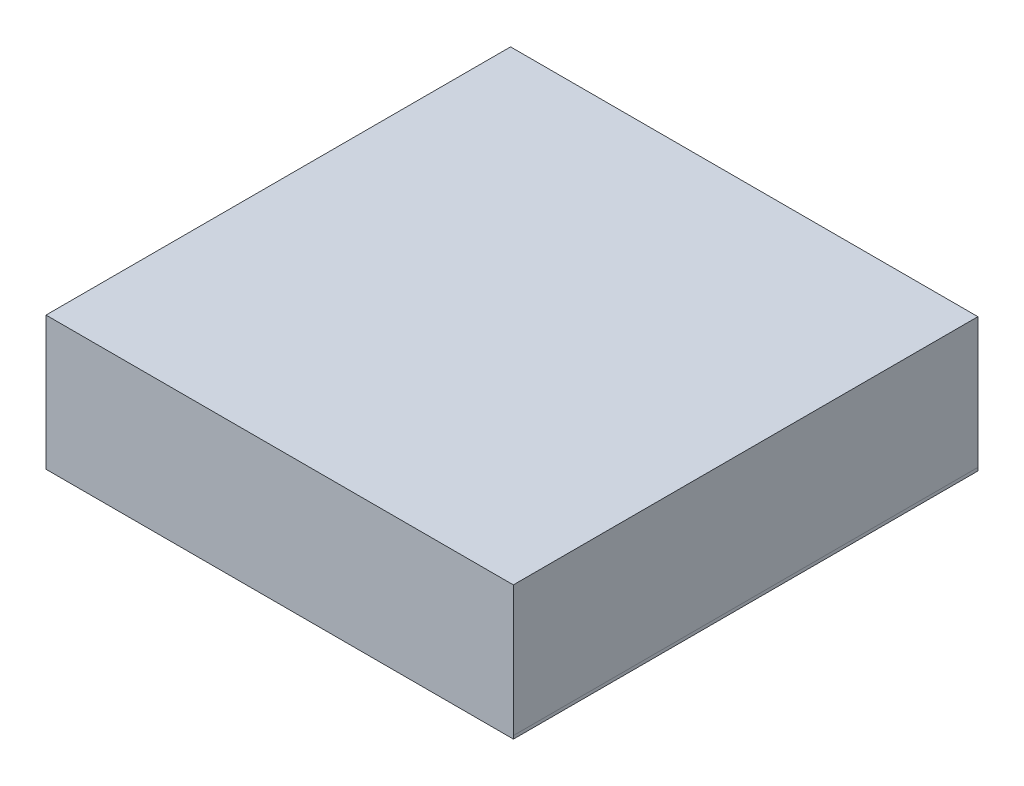
ISO-10303-21;
HEADER;
FILE_DESCRIPTION(('STEP AP214'),'2;1');
FILE_NAME('part.step','',(''),(''),'','','');
FILE_SCHEMA(('AUTOMOTIVE_DESIGN { 1 0 10303 214 1 1 1 1 }'));
ENDSEC;
DATA;
#1=APPLICATION_CONTEXT('core data for automotive mechanical design processes');
#2=APPLICATION_PROTOCOL_DEFINITION('international standard','automotive_design',2000,#1);
#3=PRODUCT_CONTEXT('',#1,'mechanical');
#4=PRODUCT('Part','Part','',(#3));
#5=PRODUCT_RELATED_PRODUCT_CATEGORY('part','',(#4));
#6=PRODUCT_DEFINITION_FORMATION('','',#4);
#7=PRODUCT_DEFINITION_CONTEXT('part definition',#1,'design');
#8=PRODUCT_DEFINITION('design','',#6,#7);
#9=PRODUCT_DEFINITION_SHAPE('','',#8);
#10=(LENGTH_UNIT() NAMED_UNIT(*) SI_UNIT(.MILLI.,.METRE.));
#11=(NAMED_UNIT(*) PLANE_ANGLE_UNIT() SI_UNIT($,.RADIAN.));
#12=(NAMED_UNIT(*) SI_UNIT($,.STERADIAN.) SOLID_ANGLE_UNIT());
#13=UNCERTAINTY_MEASURE_WITH_UNIT(LENGTH_MEASURE(1.E-05),#10,'distance_accuracy_value','');
#14=(GEOMETRIC_REPRESENTATION_CONTEXT(3) GLOBAL_UNCERTAINTY_ASSIGNED_CONTEXT((#13)) GLOBAL_UNIT_ASSIGNED_CONTEXT((#10,
#11,#12)) REPRESENTATION_CONTEXT('',''));
#15=CARTESIAN_POINT('',(0.,0.,0.));
#16=DIRECTION('',(0.,0.,1.));
#17=DIRECTION('',(1.,0.,0.));
#18=AXIS2_PLACEMENT_3D('',#15,#16,#17);
#19=CARTESIAN_POINT('',(-0.40249856,0.11500104,0.80000094));
#20=DIRECTION('',(0.,0.,-1.));
#21=DIRECTION('',(0.,-1.,0.));
#22=AXIS2_PLACEMENT_3D('',#19,#20,#21);
#23=PLANE('',#22);
#24=DIRECTION('',(0.,-1.,0.));
#25=VECTOR('',#24,1.);
#26=CARTESIAN_POINT('',(-0.40249856,0.11500104,0.80000094));
#27=LINE('',#26,#25);
#28=CARTESIAN_POINT('',(-0.40249856,0.11500104,0.80000094));
#29=VERTEX_POINT('',#28);
#30=CARTESIAN_POINT('',(-0.40249856,-0.1149985,0.80000094));
#31=VERTEX_POINT('',#30);
#32=EDGE_CURVE('E94',#29,#31,#27,.T.);
#33=ORIENTED_EDGE('',*,*,#32,.T.);
#34=DIRECTION('',(1.,0.,0.));
#35=VECTOR('',#34,1.);
#36=CARTESIAN_POINT('',(-0.40249856,-0.1149985,0.80000094));
#37=LINE('',#36,#35);
#38=CARTESIAN_POINT('',(0.40249856,-0.1149985,0.80000094));
#39=VERTEX_POINT('',#38);
#40=EDGE_CURVE('E92',#31,#39,#37,.T.);
#41=ORIENTED_EDGE('',*,*,#40,.T.);
#42=DIRECTION('',(-0.0380769102452067,0.999274811503912,0.));
#43=VECTOR('',#42,1.);
#44=CARTESIAN_POINT('',(0.40249856,-0.1149985,0.80000094));
#45=LINE('',#44,#43);
#46=CARTESIAN_POINT('',(0.40230044,-0.10979912,0.80000094));
#47=VERTEX_POINT('',#46);
#48=EDGE_CURVE('E78',#39,#47,#45,.T.);
#49=ORIENTED_EDGE('',*,*,#48,.T.);
#50=DIRECTION('',(0.,1.,0.));
#51=VECTOR('',#50,1.);
#52=CARTESIAN_POINT('',(0.40230044,-0.10979912,0.80000094));
#53=LINE('',#52,#51);
#54=CARTESIAN_POINT('',(0.40230044,0.11500104,0.80000094));
#55=VERTEX_POINT('',#54);
#56=EDGE_CURVE('E121',#47,#55,#53,.T.);
#57=ORIENTED_EDGE('',*,*,#56,.T.);
#58=DIRECTION('',(-1.,0.,0.));
#59=VECTOR('',#58,1.);
#60=CARTESIAN_POINT('',(0.40230044,0.11500104,0.80000094));
#61=LINE('',#60,#59);
#62=EDGE_CURVE('E11',#55,#29,#61,.T.);
#63=ORIENTED_EDGE('',*,*,#62,.T.);
#64=EDGE_LOOP('',(#33,#41,#49,#57,#63));
#65=FACE_BOUND('',#64,.T.);
#66=ADVANCED_FACE('F17',(#65),#23,.F.);
#67=CARTESIAN_POINT('',(-0.40249856,0.11500104,0.));
#68=DIRECTION('',(0.,0.,-1.));
#69=DIRECTION('',(0.,-1.,0.));
#70=AXIS2_PLACEMENT_3D('',#67,#68,#69);
#71=PLANE('',#70);
#72=DIRECTION('',(-1.,0.,0.));
#73=VECTOR('',#72,1.);
#74=CARTESIAN_POINT('',(0.40230044,0.11500104,0.));
#75=LINE('',#74,#73);
#76=CARTESIAN_POINT('',(0.40230044,0.11500104,0.));
#77=VERTEX_POINT('',#76);
#78=CARTESIAN_POINT('',(-0.40249856,0.11500104,0.));
#79=VERTEX_POINT('',#78);
#80=EDGE_CURVE('E25',#77,#79,#75,.T.);
#81=ORIENTED_EDGE('',*,*,#80,.F.);
#82=DIRECTION('',(0.,1.,0.));
#83=VECTOR('',#82,1.);
#84=CARTESIAN_POINT('',(0.40230044,-0.10979912,0.));
#85=LINE('',#84,#83);
#86=CARTESIAN_POINT('',(0.40230044,-0.10979912,0.));
#87=VERTEX_POINT('',#86);
#88=EDGE_CURVE('E89',#87,#77,#85,.T.);
#89=ORIENTED_EDGE('',*,*,#88,.F.);
#90=DIRECTION('',(-0.0380769102452067,0.999274811503912,0.));
#91=VECTOR('',#90,1.);
#92=CARTESIAN_POINT('',(0.40249856,-0.1149985,0.));
#93=LINE('',#92,#91);
#94=CARTESIAN_POINT('',(0.40249856,-0.1149985,0.));
#95=VERTEX_POINT('',#94);
#96=EDGE_CURVE('E99',#95,#87,#93,.T.);
#97=ORIENTED_EDGE('',*,*,#96,.F.);
#98=DIRECTION('',(1.,0.,0.));
#99=VECTOR('',#98,1.);
#100=CARTESIAN_POINT('',(-0.40249856,-0.1149985,0.));
#101=LINE('',#100,#99);
#102=CARTESIAN_POINT('',(-0.40249856,-0.1149985,0.));
#103=VERTEX_POINT('',#102);
#104=EDGE_CURVE('E102',#103,#95,#101,.T.);
#105=ORIENTED_EDGE('',*,*,#104,.F.);
#106=DIRECTION('',(0.,-1.,0.));
#107=VECTOR('',#106,1.);
#108=CARTESIAN_POINT('',(-0.40249856,0.11500104,0.));
#109=LINE('',#108,#107);
#110=EDGE_CURVE('E132',#79,#103,#109,.T.);
#111=ORIENTED_EDGE('',*,*,#110,.F.);
#112=EDGE_LOOP('',(#81,#89,#97,#105,#111));
#113=FACE_BOUND('',#112,.T.);
#114=ADVANCED_FACE('F135',(#113),#71,.T.);
#115=CARTESIAN_POINT('',(0.40230044,0.11500104,0.));
#116=DIRECTION('',(0.,-1.,0.));
#117=DIRECTION('',(0.,0.,-1.));
#118=AXIS2_PLACEMENT_3D('',#115,#116,#117);
#119=PLANE('',#118);
#120=ORIENTED_EDGE('',*,*,#80,.T.);
#121=DIRECTION('',(0.,0.,1.));
#122=VECTOR('',#121,1.);
#123=CARTESIAN_POINT('',(-0.40249856,0.11500104,0.));
#124=LINE('',#123,#122);
#125=EDGE_CURVE('E109',#79,#29,#124,.T.);
#126=ORIENTED_EDGE('',*,*,#125,.T.);
#127=ORIENTED_EDGE('',*,*,#62,.F.);
#128=DIRECTION('',(0.,0.,1.));
#129=VECTOR('',#128,1.);
#130=CARTESIAN_POINT('',(0.40230044,0.11500104,0.));
#131=LINE('',#130,#129);
#132=EDGE_CURVE('E117',#77,#55,#131,.T.);
#133=ORIENTED_EDGE('',*,*,#132,.F.);
#134=EDGE_LOOP('',(#120,#126,#127,#133));
#135=FACE_BOUND('',#134,.T.);
#136=ADVANCED_FACE('F127',(#135),#119,.F.);
#137=CARTESIAN_POINT('',(0.40230044,-0.10979912,0.));
#138=DIRECTION('',(-1.,0.,0.));
#139=DIRECTION('',(0.,0.,1.));
#140=AXIS2_PLACEMENT_3D('',#137,#138,#139);
#141=PLANE('',#140);
#142=ORIENTED_EDGE('',*,*,#88,.T.);
#143=ORIENTED_EDGE('',*,*,#132,.T.);
#144=ORIENTED_EDGE('',*,*,#56,.F.);
#145=DIRECTION('',(0.,0.,1.));
#146=VECTOR('',#145,1.);
#147=CARTESIAN_POINT('',(0.40230044,-0.10979912,0.));
#148=LINE('',#147,#146);
#149=EDGE_CURVE('E86',#87,#47,#148,.T.);
#150=ORIENTED_EDGE('',*,*,#149,.F.);
#151=EDGE_LOOP('',(#142,#143,#144,#150));
#152=FACE_BOUND('',#151,.T.);
#153=ADVANCED_FACE('F206',(#152),#141,.F.);
#154=CARTESIAN_POINT('',(0.40249856,-0.1149985,0.));
#155=DIRECTION('',(-0.999274811503912,-0.0380769102452067,0.));
#156=DIRECTION('',(-0.0380769102452067,0.999274811503912,0.));
#157=AXIS2_PLACEMENT_3D('',#154,#155,#156);
#158=PLANE('',#157);
#159=ORIENTED_EDGE('',*,*,#96,.T.);
#160=ORIENTED_EDGE('',*,*,#149,.T.);
#161=ORIENTED_EDGE('',*,*,#48,.F.);
#162=DIRECTION('',(0.,0.,1.));
#163=VECTOR('',#162,1.);
#164=CARTESIAN_POINT('',(0.40249856,-0.1149985,0.));
#165=LINE('',#164,#163);
#166=EDGE_CURVE('E83',#95,#39,#165,.T.);
#167=ORIENTED_EDGE('',*,*,#166,.F.);
#168=EDGE_LOOP('',(#159,#160,#161,#167));
#169=FACE_BOUND('',#168,.T.);
#170=ADVANCED_FACE('F81',(#169),#158,.F.);
#171=CARTESIAN_POINT('',(-0.40249856,-0.1149985,0.));
#172=DIRECTION('',(0.,1.,0.));
#173=DIRECTION('',(1.,0.,0.));
#174=AXIS2_PLACEMENT_3D('',#171,#172,#173);
#175=PLANE('',#174);
#176=ORIENTED_EDGE('',*,*,#104,.T.);
#177=ORIENTED_EDGE('',*,*,#166,.T.);
#178=ORIENTED_EDGE('',*,*,#40,.F.);
#179=DIRECTION('',(0.,0.,1.));
#180=VECTOR('',#179,1.);
#181=CARTESIAN_POINT('',(-0.40249856,-0.1149985,0.));
#182=LINE('',#181,#180);
#183=EDGE_CURVE('E137',#103,#31,#182,.T.);
#184=ORIENTED_EDGE('',*,*,#183,.F.);
#185=EDGE_LOOP('',(#176,#177,#178,#184));
#186=FACE_BOUND('',#185,.T.);
#187=ADVANCED_FACE('F101',(#186),#175,.F.);
#188=CARTESIAN_POINT('',(-0.40249856,0.11500104,0.));
#189=DIRECTION('',(1.,0.,0.));
#190=DIRECTION('',(0.,1.,0.));
#191=AXIS2_PLACEMENT_3D('',#188,#189,#190);
#192=PLANE('',#191);
#193=ORIENTED_EDGE('',*,*,#110,.T.);
#194=ORIENTED_EDGE('',*,*,#183,.T.);
#195=ORIENTED_EDGE('',*,*,#32,.F.);
#196=ORIENTED_EDGE('',*,*,#125,.F.);
#197=EDGE_LOOP('',(#193,#194,#195,#196));
#198=FACE_BOUND('',#197,.T.);
#199=ADVANCED_FACE('F131',(#198),#192,.F.);
#200=CLOSED_SHELL('',(#66,#114,#136,#153,#170,#187,#199));
#201=MANIFOLD_SOLID_BREP('B1',#200);
#202=ADVANCED_BREP_SHAPE_REPRESENTATION('',(#18,#201),#14);
#203=SHAPE_DEFINITION_REPRESENTATION(#9,#202);
ENDSEC;
END-ISO-10303-21;
